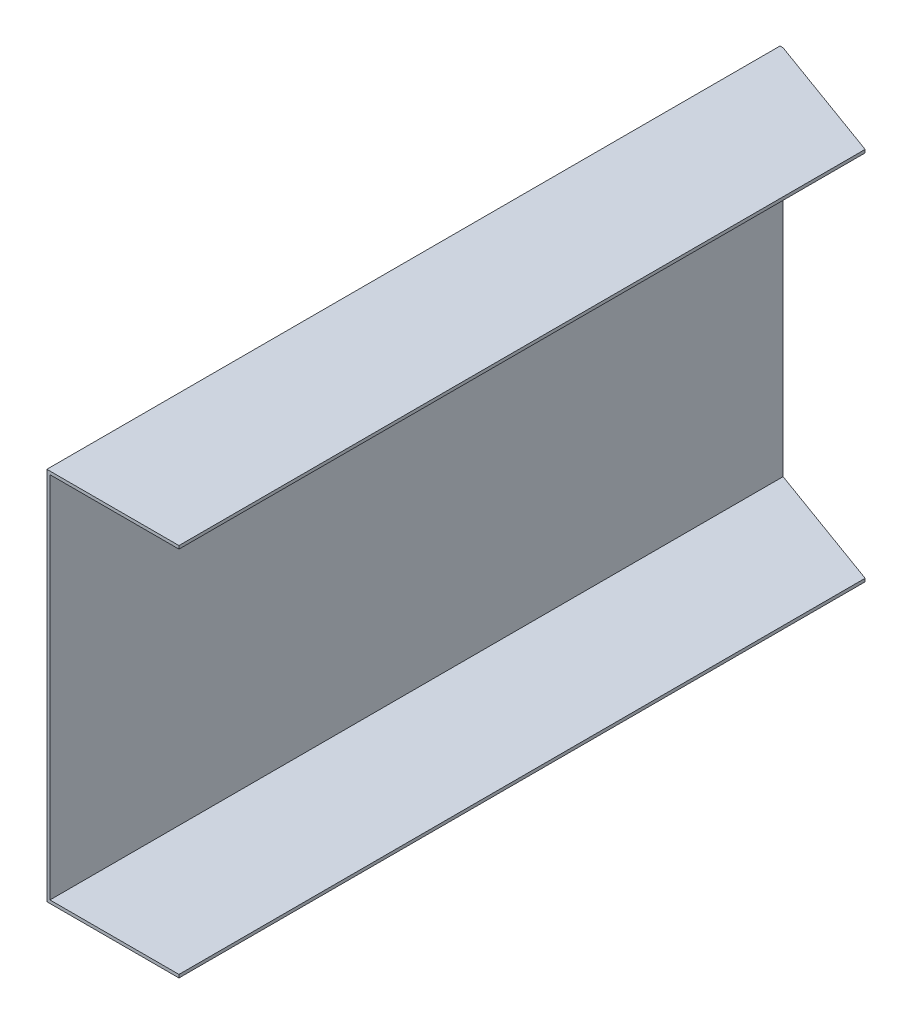
ISO-10303-21;
HEADER;
FILE_DESCRIPTION(('STEP AP214'),'2;1');
FILE_NAME('part.step','',(''),(''),'','','');
FILE_SCHEMA(('AUTOMOTIVE_DESIGN { 1 0 10303 214 1 1 1 1 }'));
ENDSEC;
DATA;
#1=APPLICATION_CONTEXT('core data for automotive mechanical design processes');
#2=APPLICATION_PROTOCOL_DEFINITION('international standard','automotive_design',2000,#1);
#3=PRODUCT_CONTEXT('',#1,'mechanical');
#4=PRODUCT('Part','Part','',(#3));
#5=PRODUCT_RELATED_PRODUCT_CATEGORY('part','',(#4));
#6=PRODUCT_DEFINITION_FORMATION('','',#4);
#7=PRODUCT_DEFINITION_CONTEXT('part definition',#1,'design');
#8=PRODUCT_DEFINITION('design','',#6,#7);
#9=PRODUCT_DEFINITION_SHAPE('','',#8);
#10=(LENGTH_UNIT() NAMED_UNIT(*) SI_UNIT(.MILLI.,.METRE.));
#11=(NAMED_UNIT(*) PLANE_ANGLE_UNIT() SI_UNIT($,.RADIAN.));
#12=(NAMED_UNIT(*) SI_UNIT($,.STERADIAN.) SOLID_ANGLE_UNIT());
#13=UNCERTAINTY_MEASURE_WITH_UNIT(LENGTH_MEASURE(1.E-05),#10,'distance_accuracy_value','');
#14=(GEOMETRIC_REPRESENTATION_CONTEXT(3) GLOBAL_UNCERTAINTY_ASSIGNED_CONTEXT((#13)) GLOBAL_UNIT_ASSIGNED_CONTEXT((#10,
#11,#12)) REPRESENTATION_CONTEXT('',''));
#15=CARTESIAN_POINT('',(0.,0.,0.));
#16=DIRECTION('',(0.,0.,1.));
#17=DIRECTION('',(1.,0.,0.));
#18=AXIS2_PLACEMENT_3D('',#15,#16,#17);
#19=CARTESIAN_POINT('',(21.59,0.,0.));
#20=DIRECTION('',(1.,0.,0.));
#21=DIRECTION('',(0.,0.,-1.));
#22=AXIS2_PLACEMENT_3D('',#19,#20,#21);
#23=PLANE('',#22);
#24=DIRECTION('',(0.,0.,-1.));
#25=VECTOR('',#24,1.);
#26=CARTESIAN_POINT('',(21.59,0.,0.));
#27=LINE('',#26,#25);
#28=CARTESIAN_POINT('',(21.59,0.,-1.905));
#29=VERTEX_POINT('',#28);
#30=CARTESIAN_POINT('',(21.59,0.,-226.2075590424));
#31=VERTEX_POINT('',#30);
#32=EDGE_CURVE('E154',#29,#31,#27,.T.);
#33=ORIENTED_EDGE('',*,*,#32,.T.);
#34=DIRECTION('',(0.,-1.,0.));
#35=VECTOR('',#34,1.);
#36=CARTESIAN_POINT('',(21.59,616.979063246816,-226.2075590424));
#37=LINE('',#36,#35);
#38=CARTESIAN_POINT('',(21.59,1.01600000000024,-226.2075590424));
#39=VERTEX_POINT('',#38);
#40=EDGE_CURVE('E136',#39,#31,#37,.T.);
#41=ORIENTED_EDGE('',*,*,#40,.F.);
#42=DIRECTION('',(0.,0.,-1.));
#43=VECTOR('',#42,1.);
#44=CARTESIAN_POINT('',(21.59,1.016,0.));
#45=LINE('',#44,#43);
#46=CARTESIAN_POINT('',(21.59,1.016,-1.905));
#47=VERTEX_POINT('',#46);
#48=EDGE_CURVE('E139',#47,#39,#45,.T.);
#49=ORIENTED_EDGE('',*,*,#48,.F.);
#50=DIRECTION('',(0.,-1.,0.));
#51=VECTOR('',#50,1.);
#52=CARTESIAN_POINT('',(21.59,0.,-1.905));
#53=LINE('',#52,#51);
#54=EDGE_CURVE('E168',#47,#29,#53,.T.);
#55=ORIENTED_EDGE('',*,*,#54,.T.);
#56=EDGE_LOOP('',(#33,#41,#49,#55));
#57=FACE_BOUND('',#56,.T.);
#58=ADVANCED_FACE('F33',(#57),#23,.T.);
#59=CARTESIAN_POINT('',(-21.59,122.428,-241.554));
#60=DIRECTION('',(0.,1.,0.));
#61=DIRECTION('',(0.,0.,1.));
#62=AXIS2_PLACEMENT_3D('',#59,#60,#61);
#63=PLANE('',#62);
#64=DIRECTION('',(0.,0.,1.));
#65=VECTOR('',#64,1.);
#66=CARTESIAN_POINT('',(21.59,122.428,-241.554));
#67=LINE('',#66,#65);
#68=CARTESIAN_POINT('',(21.59,122.428,-226.2075590424));
#69=VERTEX_POINT('',#68);
#70=CARTESIAN_POINT('',(21.59,122.428,-1.90499999999999));
#71=VERTEX_POINT('',#70);
#72=EDGE_CURVE('E156',#69,#71,#67,.T.);
#73=ORIENTED_EDGE('',*,*,#72,.F.);
#74=DIRECTION('',(-0.939692620785908,0.,-0.342020143325669));
#75=VECTOR('',#74,1.);
#76=CARTESIAN_POINT('',(-21.4711505771044,122.428,-241.880536105721));
#77=LINE('',#76,#75);
#78=CARTESIAN_POINT('',(-20.574,122.428,-241.554));
#79=VERTEX_POINT('',#78);
#80=EDGE_CURVE('E52',#69,#79,#77,.T.);
#81=ORIENTED_EDGE('',*,*,#80,.T.);
#82=DIRECTION('',(1.,0.,0.));
#83=VECTOR('',#82,1.);
#84=CARTESIAN_POINT('',(-21.59,122.428,-241.554));
#85=LINE('',#84,#83);
#86=CARTESIAN_POINT('',(-21.59,122.428,-241.554));
#87=VERTEX_POINT('',#86);
#88=EDGE_CURVE('E43',#87,#79,#85,.T.);
#89=ORIENTED_EDGE('',*,*,#88,.F.);
#90=DIRECTION('',(0.,0.,1.));
#91=VECTOR('',#90,1.);
#92=CARTESIAN_POINT('',(-21.59,122.428,-241.554));
#93=LINE('',#92,#91);
#94=CARTESIAN_POINT('',(-21.59,122.428,-1.90499999999999));
#95=VERTEX_POINT('',#94);
#96=EDGE_CURVE('E163',#87,#95,#93,.T.);
#97=ORIENTED_EDGE('',*,*,#96,.T.);
#98=DIRECTION('',(1.,0.,0.));
#99=VECTOR('',#98,1.);
#100=CARTESIAN_POINT('',(-21.59,122.428,-1.90499999999999));
#101=LINE('',#100,#99);
#102=EDGE_CURVE('E12',#95,#71,#101,.T.);
#103=ORIENTED_EDGE('',*,*,#102,.T.);
#104=EDGE_LOOP('',(#73,#81,#89,#97,#103));
#105=FACE_BOUND('',#104,.T.);
#106=ADVANCED_FACE('F185',(#105),#63,.T.);
#107=CARTESIAN_POINT('',(-21.59,0.,-241.554));
#108=DIRECTION('',(0.,0.,-1.));
#109=DIRECTION('',(-1.,0.,0.));
#110=AXIS2_PLACEMENT_3D('',#107,#108,#109);
#111=PLANE('',#110);
#112=ORIENTED_EDGE('',*,*,#88,.T.);
#113=DIRECTION('',(0.,-1.,0.));
#114=VECTOR('',#113,1.);
#115=CARTESIAN_POINT('',(-20.574,616.979063246816,-241.554));
#116=LINE('',#115,#114);
#117=CARTESIAN_POINT('',(-20.574,121.412,-241.554));
#118=VERTEX_POINT('',#117);
#119=EDGE_CURVE('E121',#79,#118,#116,.T.);
#120=ORIENTED_EDGE('',*,*,#119,.T.);
#121=DIRECTION('',(0.,1.,0.));
#122=VECTOR('',#121,1.);
#123=CARTESIAN_POINT('',(-20.574,0.,-241.554));
#124=LINE('',#123,#122);
#125=CARTESIAN_POINT('',(-20.574,1.016,-241.554));
#126=VERTEX_POINT('',#125);
#127=EDGE_CURVE('E118',#126,#118,#124,.T.);
#128=ORIENTED_EDGE('',*,*,#127,.F.);
#129=CARTESIAN_POINT('',(-20.5740000000001,0.,-241.554));
#130=VERTEX_POINT('',#129);
#131=EDGE_CURVE('E110',#126,#130,#116,.T.);
#132=ORIENTED_EDGE('',*,*,#131,.T.);
#133=DIRECTION('',(1.,0.,0.));
#134=VECTOR('',#133,1.);
#135=CARTESIAN_POINT('',(-21.59,0.,-241.554));
#136=LINE('',#135,#134);
#137=CARTESIAN_POINT('',(-21.59,0.,-241.554));
#138=VERTEX_POINT('',#137);
#139=EDGE_CURVE('E114',#138,#130,#136,.T.);
#140=ORIENTED_EDGE('',*,*,#139,.F.);
#141=DIRECTION('',(0.,1.,0.));
#142=VECTOR('',#141,1.);
#143=CARTESIAN_POINT('',(-21.59,0.,-241.554));
#144=LINE('',#143,#142);
#145=EDGE_CURVE('E161',#138,#87,#144,.T.);
#146=ORIENTED_EDGE('',*,*,#145,.T.);
#147=EDGE_LOOP('',(#112,#120,#128,#132,#140,#146));
#148=FACE_BOUND('',#147,.T.);
#149=ADVANCED_FACE('F112',(#148),#111,.T.);
#150=CARTESIAN_POINT('',(-21.59,0.,0.));
#151=DIRECTION('',(0.,-1.,0.));
#152=DIRECTION('',(0.,0.,-1.));
#153=AXIS2_PLACEMENT_3D('',#150,#151,#152);
#154=PLANE('',#153);
#155=ORIENTED_EDGE('',*,*,#139,.T.);
#156=DIRECTION('',(0.939692620785908,0.,0.342020143325669));
#157=VECTOR('',#156,1.);
#158=CARTESIAN_POINT('',(56.1628085580068,0.,-213.624085812301));
#159=LINE('',#158,#157);
#160=EDGE_CURVE('E127',#130,#31,#159,.T.);
#161=ORIENTED_EDGE('',*,*,#160,.T.);
#162=ORIENTED_EDGE('',*,*,#32,.F.);
#163=DIRECTION('',(1.,0.,0.));
#164=VECTOR('',#163,1.);
#165=CARTESIAN_POINT('',(-21.59,0.,-1.905));
#166=LINE('',#165,#164);
#167=CARTESIAN_POINT('',(-21.59,0.,-1.905));
#168=VERTEX_POINT('',#167);
#169=EDGE_CURVE('E131',#168,#29,#166,.T.);
#170=ORIENTED_EDGE('',*,*,#169,.F.);
#171=DIRECTION('',(0.,0.,-1.));
#172=VECTOR('',#171,1.);
#173=CARTESIAN_POINT('',(-21.59,0.,0.));
#174=LINE('',#173,#172);
#175=EDGE_CURVE('E130',#168,#138,#174,.T.);
#176=ORIENTED_EDGE('',*,*,#175,.T.);
#177=EDGE_LOOP('',(#155,#161,#162,#170,#176));
#178=FACE_BOUND('',#177,.T.);
#179=ADVANCED_FACE('F125',(#178),#154,.T.);
#180=DIRECTION('',(0.,0.,1.));
#181=VECTOR('',#180,1.);
#182=CARTESIAN_POINT('',(21.59,121.412,0.));
#183=LINE('',#182,#181);
#184=CARTESIAN_POINT('',(21.59,121.412,-226.2075590424));
#185=VERTEX_POINT('',#184);
#186=CARTESIAN_POINT('',(21.59,121.412,-1.905));
#187=VERTEX_POINT('',#186);
#188=EDGE_CURVE('E151',#185,#187,#183,.T.);
#189=ORIENTED_EDGE('',*,*,#188,.F.);
#190=EDGE_CURVE('E184',#69,#185,#37,.T.);
#191=ORIENTED_EDGE('',*,*,#190,.F.);
#192=ORIENTED_EDGE('',*,*,#72,.T.);
#193=DIRECTION('',(0.,-1.,0.));
#194=VECTOR('',#193,1.);
#195=CARTESIAN_POINT('',(21.59,0.,-1.905));
#196=LINE('',#195,#194);
#197=EDGE_CURVE('E157',#71,#187,#196,.T.);
#198=ORIENTED_EDGE('',*,*,#197,.T.);
#199=EDGE_LOOP('',(#189,#191,#192,#198));
#200=FACE_BOUND('',#199,.T.);
#201=ADVANCED_FACE('F182',(#200),#23,.T.);
#202=CARTESIAN_POINT('',(-21.59,121.412,-241.554));
#203=DIRECTION('',(0.,1.,0.));
#204=DIRECTION('',(0.,0.,1.));
#205=AXIS2_PLACEMENT_3D('',#202,#203,#204);
#206=PLANE('',#205);
#207=DIRECTION('',(-0.939692620785908,0.,-0.342020143325669));
#208=VECTOR('',#207,1.);
#209=CARTESIAN_POINT('',(-21.4711505771044,121.412,-241.880536105721));
#210=LINE('',#209,#208);
#211=EDGE_CURVE('E137',#185,#118,#210,.T.);
#212=ORIENTED_EDGE('',*,*,#211,.F.);
#213=ORIENTED_EDGE('',*,*,#188,.T.);
#214=DIRECTION('',(1.,0.,0.));
#215=VECTOR('',#214,1.);
#216=CARTESIAN_POINT('',(-21.59,121.412,-1.90499999999999));
#217=LINE('',#216,#215);
#218=CARTESIAN_POINT('',(-20.574,121.412,-1.905));
#219=VERTEX_POINT('',#218);
#220=EDGE_CURVE('E86',#219,#187,#217,.T.);
#221=ORIENTED_EDGE('',*,*,#220,.F.);
#222=DIRECTION('',(0.,0.,1.));
#223=VECTOR('',#222,1.);
#224=CARTESIAN_POINT('',(-20.574,121.412,0.));
#225=LINE('',#224,#223);
#226=EDGE_CURVE('E145',#118,#219,#225,.T.);
#227=ORIENTED_EDGE('',*,*,#226,.F.);
#228=EDGE_LOOP('',(#212,#213,#221,#227));
#229=FACE_BOUND('',#228,.T.);
#230=ADVANCED_FACE('F196',(#229),#206,.F.);
#231=CARTESIAN_POINT('',(-21.59,1.016,0.));
#232=DIRECTION('',(0.,-1.,0.));
#233=DIRECTION('',(0.,0.,-1.));
#234=AXIS2_PLACEMENT_3D('',#231,#232,#233);
#235=PLANE('',#234);
#236=DIRECTION('',(0.939692620785908,0.,0.342020143325669));
#237=VECTOR('',#236,1.);
#238=CARTESIAN_POINT('',(56.1628085580068,1.016,-213.624085812301));
#239=LINE('',#238,#237);
#240=EDGE_CURVE('E94',#126,#39,#239,.T.);
#241=ORIENTED_EDGE('',*,*,#240,.F.);
#242=DIRECTION('',(0.,0.,-1.));
#243=VECTOR('',#242,1.);
#244=CARTESIAN_POINT('',(-20.574,1.016,0.));
#245=LINE('',#244,#243);
#246=CARTESIAN_POINT('',(-20.574,1.016,-1.905));
#247=VERTEX_POINT('',#246);
#248=EDGE_CURVE('E148',#247,#126,#245,.T.);
#249=ORIENTED_EDGE('',*,*,#248,.F.);
#250=DIRECTION('',(1.,0.,0.));
#251=VECTOR('',#250,1.);
#252=CARTESIAN_POINT('',(-21.59,1.016,-1.905));
#253=LINE('',#252,#251);
#254=EDGE_CURVE('E147',#247,#47,#253,.T.);
#255=ORIENTED_EDGE('',*,*,#254,.T.);
#256=ORIENTED_EDGE('',*,*,#48,.T.);
#257=EDGE_LOOP('',(#241,#249,#255,#256));
#258=FACE_BOUND('',#257,.T.);
#259=ADVANCED_FACE('F199',(#258),#235,.F.);
#260=CARTESIAN_POINT('',(-21.59,122.428,-1.905));
#261=DIRECTION('',(0.,0.,1.));
#262=DIRECTION('',(1.,0.,0.));
#263=AXIS2_PLACEMENT_3D('',#260,#261,#262);
#264=PLANE('',#263);
#265=ORIENTED_EDGE('',*,*,#254,.F.);
#266=DIRECTION('',(0.,-1.,0.));
#267=VECTOR('',#266,1.);
#268=CARTESIAN_POINT('',(-20.574,0.,-1.905));
#269=LINE('',#268,#267);
#270=EDGE_CURVE('E37',#219,#247,#269,.T.);
#271=ORIENTED_EDGE('',*,*,#270,.F.);
#272=ORIENTED_EDGE('',*,*,#220,.T.);
#273=ORIENTED_EDGE('',*,*,#197,.F.);
#274=ORIENTED_EDGE('',*,*,#102,.F.);
#275=DIRECTION('',(0.,-1.,0.));
#276=VECTOR('',#275,1.);
#277=CARTESIAN_POINT('',(-21.59,0.,-1.905));
#278=LINE('',#277,#276);
#279=EDGE_CURVE('E159',#95,#168,#278,.T.);
#280=ORIENTED_EDGE('',*,*,#279,.T.);
#281=ORIENTED_EDGE('',*,*,#169,.T.);
#282=ORIENTED_EDGE('',*,*,#54,.F.);
#283=EDGE_LOOP('',(#265,#271,#272,#273,#274,#280,#281,#282));
#284=FACE_BOUND('',#283,.T.);
#285=ADVANCED_FACE('F35',(#284),#264,.T.);
#286=CARTESIAN_POINT('',(-21.59,0.,0.));
#287=DIRECTION('',(1.,0.,0.));
#288=DIRECTION('',(0.,0.,-1.));
#289=AXIS2_PLACEMENT_3D('',#286,#287,#288);
#290=PLANE('',#289);
#291=ORIENTED_EDGE('',*,*,#279,.F.);
#292=ORIENTED_EDGE('',*,*,#96,.F.);
#293=ORIENTED_EDGE('',*,*,#145,.F.);
#294=ORIENTED_EDGE('',*,*,#175,.F.);
#295=EDGE_LOOP('',(#291,#292,#293,#294));
#296=FACE_BOUND('',#295,.T.);
#297=ADVANCED_FACE('F189',(#296),#290,.F.);
#298=CARTESIAN_POINT('',(-20.574,0.,0.));
#299=DIRECTION('',(1.,0.,0.));
#300=DIRECTION('',(0.,0.,-1.));
#301=AXIS2_PLACEMENT_3D('',#298,#299,#300);
#302=PLANE('',#301);
#303=ORIENTED_EDGE('',*,*,#270,.T.);
#304=ORIENTED_EDGE('',*,*,#248,.T.);
#305=ORIENTED_EDGE('',*,*,#127,.T.);
#306=ORIENTED_EDGE('',*,*,#226,.T.);
#307=EDGE_LOOP('',(#303,#304,#305,#306));
#308=FACE_BOUND('',#307,.T.);
#309=ADVANCED_FACE('F198',(#308),#302,.T.);
#310=CARTESIAN_POINT('',(-20.574,616.979063246816,-241.554));
#311=DIRECTION('',(0.342020143325669,0.,-0.939692620785908));
#312=DIRECTION('',(-0.939692620785908,0.,-0.342020143325669));
#313=AXIS2_PLACEMENT_3D('',#310,#311,#312);
#314=PLANE('',#313);
#315=ORIENTED_EDGE('',*,*,#160,.F.);
#316=ORIENTED_EDGE('',*,*,#131,.F.);
#317=ORIENTED_EDGE('',*,*,#240,.T.);
#318=ORIENTED_EDGE('',*,*,#40,.T.);
#319=EDGE_LOOP('',(#315,#316,#317,#318));
#320=FACE_BOUND('',#319,.T.);
#321=ADVANCED_FACE('F134',(#320),#314,.T.);
#322=ORIENTED_EDGE('',*,*,#80,.F.);
#323=ORIENTED_EDGE('',*,*,#190,.T.);
#324=ORIENTED_EDGE('',*,*,#211,.T.);
#325=ORIENTED_EDGE('',*,*,#119,.F.);
#326=EDGE_LOOP('',(#322,#323,#324,#325));
#327=FACE_BOUND('',#326,.T.);
#328=ADVANCED_FACE('F193',(#327),#314,.T.);
#329=CLOSED_SHELL('',(#58,#106,#149,#179,#201,#230,#259,#285,#297,#309,#321,#328));
#330=MANIFOLD_SOLID_BREP('B2',#329);
#331=ADVANCED_BREP_SHAPE_REPRESENTATION('',(#18,#330),#14);
#332=SHAPE_DEFINITION_REPRESENTATION(#9,#331);
ENDSEC;
END-ISO-10303-21;
